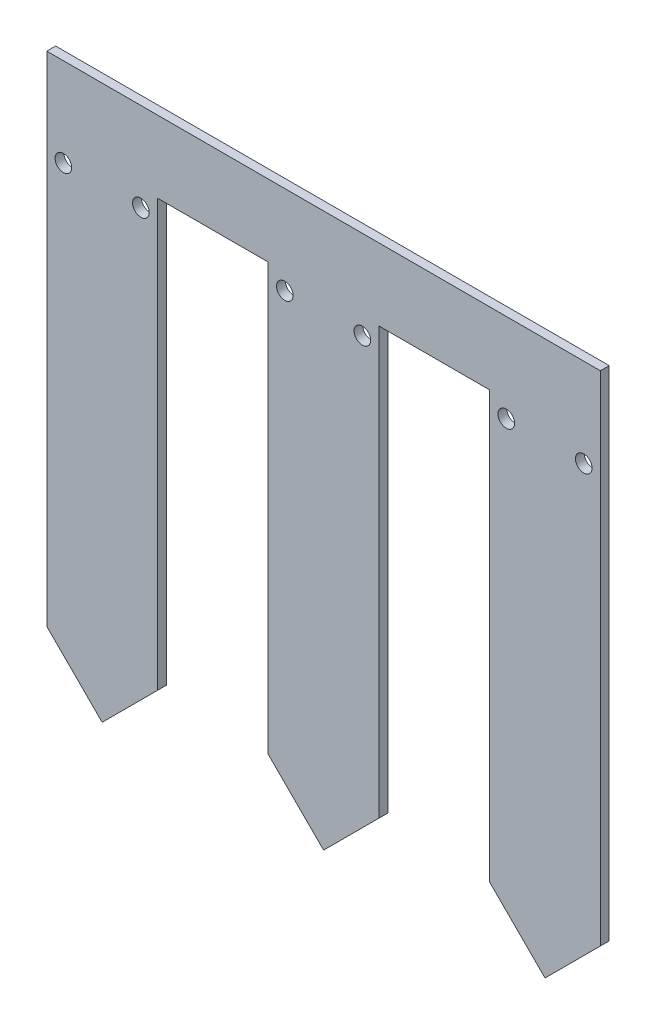
ISO-10303-21;
HEADER;
FILE_DESCRIPTION(('STEP AP214'),'2;1');
FILE_NAME('part.step','',(''),(''),'','','');
FILE_SCHEMA(('AUTOMOTIVE_DESIGN { 1 0 10303 214 1 1 1 1 }'));
ENDSEC;
DATA;
#1=APPLICATION_CONTEXT('core data for automotive mechanical design processes');
#2=APPLICATION_PROTOCOL_DEFINITION('international standard','automotive_design',2000,#1);
#3=PRODUCT_CONTEXT('',#1,'mechanical');
#4=PRODUCT('Part','Part','',(#3));
#5=PRODUCT_RELATED_PRODUCT_CATEGORY('part','',(#4));
#6=PRODUCT_DEFINITION_FORMATION('','',#4);
#7=PRODUCT_DEFINITION_CONTEXT('part definition',#1,'design');
#8=PRODUCT_DEFINITION('design','',#6,#7);
#9=PRODUCT_DEFINITION_SHAPE('','',#8);
#10=(LENGTH_UNIT() NAMED_UNIT(*) SI_UNIT(.MILLI.,.METRE.));
#11=(NAMED_UNIT(*) PLANE_ANGLE_UNIT() SI_UNIT($,.RADIAN.));
#12=(NAMED_UNIT(*) SI_UNIT($,.STERADIAN.) SOLID_ANGLE_UNIT());
#13=UNCERTAINTY_MEASURE_WITH_UNIT(LENGTH_MEASURE(1.E-05),#10,'distance_accuracy_value','');
#14=(GEOMETRIC_REPRESENTATION_CONTEXT(3) GLOBAL_UNCERTAINTY_ASSIGNED_CONTEXT((#13)) GLOBAL_UNIT_ASSIGNED_CONTEXT((#10,
#11,#12)) REPRESENTATION_CONTEXT('',''));
#15=CARTESIAN_POINT('',(0.,0.,0.));
#16=DIRECTION('',(0.,0.,1.));
#17=DIRECTION('',(1.,0.,0.));
#18=AXIS2_PLACEMENT_3D('',#15,#16,#17);
#19=CARTESIAN_POINT('',(0.,0.,1.6));
#20=DIRECTION('',(0.,0.,1.));
#21=DIRECTION('',(1.,0.,0.));
#22=AXIS2_PLACEMENT_3D('',#19,#20,#21);
#23=PLANE('',#22);
#24=CARTESIAN_POINT('',(86.9999999999998,29.0000000000001,1.6));
#25=DIRECTION('',(0.,0.,1.));
#26=DIRECTION('',(1.,0.,0.));
#27=AXIS2_PLACEMENT_3D('',#24,#25,#26);
#28=CIRCLE('',#27,1.5);
#29=CARTESIAN_POINT('',(88.4999999999998,29.0000000000001,1.6));
#30=VERTEX_POINT('',#29);
#31=EDGE_CURVE('E371',#30,#30,#28,.T.);
#32=ORIENTED_EDGE('',*,*,#31,.F.);
#33=EDGE_LOOP('',(#32));
#34=FACE_BOUND('',#33,.T.);
#35=CARTESIAN_POINT('',(32.9999999999999,29.0000000000001,1.6));
#36=DIRECTION('',(0.,0.,1.));
#37=DIRECTION('',(1.,0.,0.));
#38=AXIS2_PLACEMENT_3D('',#35,#36,#37);
#39=CIRCLE('',#38,1.5);
#40=CARTESIAN_POINT('',(34.4999999999999,29.0000000000001,1.6));
#41=VERTEX_POINT('',#40);
#42=EDGE_CURVE('E355',#41,#41,#39,.T.);
#43=ORIENTED_EDGE('',*,*,#42,.F.);
#44=EDGE_LOOP('',(#43));
#45=FACE_BOUND('',#44,.T.);
#46=CARTESIAN_POINT('',(-7.,29.0000000000001,1.6));
#47=DIRECTION('',(0.,0.,1.));
#48=DIRECTION('',(1.,0.,0.));
#49=AXIS2_PLACEMENT_3D('',#46,#47,#48);
#50=CIRCLE('',#49,1.5);
#51=CARTESIAN_POINT('',(-5.5,29.0000000000001,1.6));
#52=VERTEX_POINT('',#51);
#53=EDGE_CURVE('E193',#52,#52,#50,.T.);
#54=ORIENTED_EDGE('',*,*,#53,.F.);
#55=EDGE_LOOP('',(#54));
#56=FACE_BOUND('',#55,.T.);
#57=DIRECTION('',(0.,-1.,0.));
#58=VECTOR('',#57,1.);
#59=CARTESIAN_POINT('',(-10.,45.,1.6));
#60=LINE('',#59,#58);
#61=CARTESIAN_POINT('',(-10.,45.,1.6));
#62=VERTEX_POINT('',#61);
#63=CARTESIAN_POINT('',(-10.,-45.,1.6));
#64=VERTEX_POINT('',#63);
#65=EDGE_CURVE('E233',#62,#64,#60,.T.);
#66=ORIENTED_EDGE('',*,*,#65,.T.);
#67=DIRECTION('',(0.707106781186551,-0.707106781186545,0.));
#68=VECTOR('',#67,1.);
#69=CARTESIAN_POINT('',(0.,-54.9999999999999,1.6));
#70=LINE('',#69,#68);
#71=CARTESIAN_POINT('',(0.,-54.9999999999999,1.6));
#72=VERTEX_POINT('',#71);
#73=EDGE_CURVE('E123',#64,#72,#70,.T.);
#74=ORIENTED_EDGE('',*,*,#73,.T.);
#75=DIRECTION('',(0.707106781186547,0.707106781186548,0.));
#76=VECTOR('',#75,1.);
#77=CARTESIAN_POINT('',(0.,-54.9999999999999,1.6));
#78=LINE('',#77,#76);
#79=CARTESIAN_POINT('',(9.9999999999999,-45.,1.6));
#80=VERTEX_POINT('',#79);
#81=EDGE_CURVE('E282',#72,#80,#78,.T.);
#82=ORIENTED_EDGE('',*,*,#81,.T.);
#83=DIRECTION('',(0.,1.,0.));
#84=VECTOR('',#83,1.);
#85=CARTESIAN_POINT('',(9.9999999999999,32.0000000000001,1.6));
#86=LINE('',#85,#84);
#87=CARTESIAN_POINT('',(9.9999999999999,32.0000000000001,1.6));
#88=VERTEX_POINT('',#87);
#89=EDGE_CURVE('E300',#80,#88,#86,.T.);
#90=ORIENTED_EDGE('',*,*,#89,.T.);
#91=DIRECTION('',(1.,0.,0.));
#92=VECTOR('',#91,1.);
#93=CARTESIAN_POINT('',(9.9999999999999,32.0000000000001,1.6));
#94=LINE('',#93,#92);
#95=CARTESIAN_POINT('',(29.9999999999999,32.0000000000001,1.6));
#96=VERTEX_POINT('',#95);
#97=EDGE_CURVE('E296',#88,#96,#94,.T.);
#98=ORIENTED_EDGE('',*,*,#97,.T.);
#99=DIRECTION('',(0.,-1.,0.));
#100=VECTOR('',#99,1.);
#101=CARTESIAN_POINT('',(29.9999999999999,32.0000000000001,1.6));
#102=LINE('',#101,#100);
#103=CARTESIAN_POINT('',(30.,-44.9999999999999,1.6));
#104=VERTEX_POINT('',#103);
#105=EDGE_CURVE('E299',#96,#104,#102,.T.);
#106=ORIENTED_EDGE('',*,*,#105,.T.);
#107=DIRECTION('',(0.707106781186545,-0.70710678118655,0.));
#108=VECTOR('',#107,1.);
#109=CARTESIAN_POINT('',(30.,-44.9999999999999,1.6));
#110=LINE('',#109,#108);
#111=CARTESIAN_POINT('',(39.9999999999999,-54.9999999999999,1.6));
#112=VERTEX_POINT('',#111);
#113=EDGE_CURVE('E304',#104,#112,#110,.T.);
#114=ORIENTED_EDGE('',*,*,#113,.T.);
#115=DIRECTION('',(0.707106781186547,0.707106781186548,0.));
#116=VECTOR('',#115,1.);
#117=CARTESIAN_POINT('',(39.9999999999999,-54.9999999999999,1.6));
#118=LINE('',#117,#116);
#119=CARTESIAN_POINT('',(49.9999999999999,-44.9999999999999,1.6));
#120=VERTEX_POINT('',#119);
#121=EDGE_CURVE('E311',#112,#120,#118,.T.);
#122=ORIENTED_EDGE('',*,*,#121,.T.);
#123=DIRECTION('',(0.,1.,0.));
#124=VECTOR('',#123,1.);
#125=CARTESIAN_POINT('',(49.9999999999999,-44.9999999999999,1.6));
#126=LINE('',#125,#124);
#127=CARTESIAN_POINT('',(49.9999999999999,32.0000000000001,1.6));
#128=VERTEX_POINT('',#127);
#129=EDGE_CURVE('E314',#120,#128,#126,.T.);
#130=ORIENTED_EDGE('',*,*,#129,.T.);
#131=DIRECTION('',(1.,0.,0.));
#132=VECTOR('',#131,1.);
#133=CARTESIAN_POINT('',(49.9999999999999,32.0000000000001,1.6));
#134=LINE('',#133,#132);
#135=CARTESIAN_POINT('',(69.9999999999999,32.0000000000001,1.6));
#136=VERTEX_POINT('',#135);
#137=EDGE_CURVE('E317',#128,#136,#134,.T.);
#138=ORIENTED_EDGE('',*,*,#137,.T.);
#139=DIRECTION('',(0.,-1.,0.));
#140=VECTOR('',#139,1.);
#141=CARTESIAN_POINT('',(69.9999999999999,32.0000000000001,1.6));
#142=LINE('',#141,#140);
#143=CARTESIAN_POINT('',(69.9999999999999,-44.9999999999999,1.6));
#144=VERTEX_POINT('',#143);
#145=EDGE_CURVE('E320',#136,#144,#142,.T.);
#146=ORIENTED_EDGE('',*,*,#145,.T.);
#147=DIRECTION('',(0.707106781186548,-0.707106781186547,0.));
#148=VECTOR('',#147,1.);
#149=CARTESIAN_POINT('',(69.9999999999999,-44.9999999999999,1.6));
#150=LINE('',#149,#148);
#151=CARTESIAN_POINT('',(79.9999999999999,-54.9999999999998,1.6));
#152=VERTEX_POINT('',#151);
#153=EDGE_CURVE('E164',#144,#152,#150,.T.);
#154=ORIENTED_EDGE('',*,*,#153,.T.);
#155=DIRECTION('',(0.707106781186547,0.707106781186548,0.));
#156=VECTOR('',#155,1.);
#157=CARTESIAN_POINT('',(79.9999999999999,-54.9999999999998,1.6));
#158=LINE('',#157,#156);
#159=CARTESIAN_POINT('',(89.9999999999998,-44.9999999999998,1.6));
#160=VERTEX_POINT('',#159);
#161=EDGE_CURVE('E157',#152,#160,#158,.T.);
#162=ORIENTED_EDGE('',*,*,#161,.T.);
#163=DIRECTION('',(0.,1.,0.));
#164=VECTOR('',#163,1.);
#165=CARTESIAN_POINT('',(89.9999999999998,-44.9999999999998,1.6));
#166=LINE('',#165,#164);
#167=CARTESIAN_POINT('',(89.9999999999998,45.,1.6));
#168=VERTEX_POINT('',#167);
#169=EDGE_CURVE('E161',#160,#168,#166,.T.);
#170=ORIENTED_EDGE('',*,*,#169,.T.);
#171=DIRECTION('',(-1.,0.,0.));
#172=VECTOR('',#171,1.);
#173=CARTESIAN_POINT('',(10.,45.,1.6));
#174=LINE('',#173,#172);
#175=EDGE_CURVE('E61',#168,#62,#174,.T.);
#176=ORIENTED_EDGE('',*,*,#175,.T.);
#177=EDGE_LOOP('',(#66,#74,#82,#90,#98,#106,#114,#122,#130,#138,#146,#154,#162,#170,#176));
#178=FACE_BOUND('',#177,.T.);
#179=CARTESIAN_POINT('',(7.,29.0000000000001,1.6));
#180=DIRECTION('',(0.,0.,1.));
#181=DIRECTION('',(1.,0.,0.));
#182=AXIS2_PLACEMENT_3D('',#179,#180,#181);
#183=CIRCLE('',#182,1.5);
#184=CARTESIAN_POINT('',(8.5,29.0000000000001,1.6));
#185=VERTEX_POINT('',#184);
#186=EDGE_CURVE('E347',#185,#185,#183,.T.);
#187=ORIENTED_EDGE('',*,*,#186,.F.);
#188=EDGE_LOOP('',(#187));
#189=FACE_BOUND('',#188,.T.);
#190=CARTESIAN_POINT('',(46.9999999999999,29.0000000000001,1.6));
#191=DIRECTION('',(0.,0.,1.));
#192=DIRECTION('',(1.,0.,0.));
#193=AXIS2_PLACEMENT_3D('',#190,#191,#192);
#194=CIRCLE('',#193,1.5);
#195=CARTESIAN_POINT('',(48.4999999999999,29.0000000000001,1.6));
#196=VERTEX_POINT('',#195);
#197=EDGE_CURVE('E363',#196,#196,#194,.T.);
#198=ORIENTED_EDGE('',*,*,#197,.F.);
#199=EDGE_LOOP('',(#198));
#200=FACE_BOUND('',#199,.T.);
#201=CARTESIAN_POINT('',(72.9999999999999,29.0000000000001,1.6));
#202=DIRECTION('',(0.,0.,1.));
#203=DIRECTION('',(1.,0.,0.));
#204=AXIS2_PLACEMENT_3D('',#201,#202,#203);
#205=CIRCLE('',#204,1.5);
#206=CARTESIAN_POINT('',(74.4999999999999,29.0000000000001,1.6));
#207=VERTEX_POINT('',#206);
#208=EDGE_CURVE('E379',#207,#207,#205,.T.);
#209=ORIENTED_EDGE('',*,*,#208,.F.);
#210=EDGE_LOOP('',(#209));
#211=FACE_BOUND('',#210,.T.);
#212=ADVANCED_FACE('F43',(#34,#45,#56,#178,#189,#200,#211),#23,.T.);
#213=CARTESIAN_POINT('',(0.,0.,0.));
#214=DIRECTION('',(0.,0.,1.));
#215=DIRECTION('',(1.,0.,0.));
#216=AXIS2_PLACEMENT_3D('',#213,#214,#215);
#217=PLANE('',#216);
#218=DIRECTION('',(0.,-1.,0.));
#219=VECTOR('',#218,1.);
#220=CARTESIAN_POINT('',(-10.,45.,0.));
#221=LINE('',#220,#219);
#222=CARTESIAN_POINT('',(-10.,45.,0.));
#223=VERTEX_POINT('',#222);
#224=CARTESIAN_POINT('',(-10.,-45.,0.));
#225=VERTEX_POINT('',#224);
#226=EDGE_CURVE('E188',#223,#225,#221,.T.);
#227=ORIENTED_EDGE('',*,*,#226,.F.);
#228=DIRECTION('',(-1.,0.,0.));
#229=VECTOR('',#228,1.);
#230=CARTESIAN_POINT('',(-10.,45.,0.));
#231=LINE('',#230,#229);
#232=CARTESIAN_POINT('',(89.9999999999998,45.,0.));
#233=VERTEX_POINT('',#232);
#234=EDGE_CURVE('E111',#233,#223,#231,.T.);
#235=ORIENTED_EDGE('',*,*,#234,.F.);
#236=DIRECTION('',(0.,1.,0.));
#237=VECTOR('',#236,1.);
#238=CARTESIAN_POINT('',(89.9999999999998,-44.9999999999998,0.));
#239=LINE('',#238,#237);
#240=CARTESIAN_POINT('',(89.9999999999998,-44.9999999999998,0.));
#241=VERTEX_POINT('',#240);
#242=EDGE_CURVE('E228',#241,#233,#239,.T.);
#243=ORIENTED_EDGE('',*,*,#242,.F.);
#244=DIRECTION('',(0.707106781186547,0.707106781186548,0.));
#245=VECTOR('',#244,1.);
#246=CARTESIAN_POINT('',(79.9999999999999,-54.9999999999998,0.));
#247=LINE('',#246,#245);
#248=CARTESIAN_POINT('',(79.9999999999999,-54.9999999999998,0.));
#249=VERTEX_POINT('',#248);
#250=EDGE_CURVE('E174',#249,#241,#247,.T.);
#251=ORIENTED_EDGE('',*,*,#250,.F.);
#252=DIRECTION('',(0.707106781186548,-0.707106781186547,0.));
#253=VECTOR('',#252,1.);
#254=CARTESIAN_POINT('',(69.9999999999999,-44.9999999999999,0.));
#255=LINE('',#254,#253);
#256=CARTESIAN_POINT('',(69.9999999999999,-44.9999999999999,0.));
#257=VERTEX_POINT('',#256);
#258=EDGE_CURVE('E223',#257,#249,#255,.T.);
#259=ORIENTED_EDGE('',*,*,#258,.F.);
#260=DIRECTION('',(0.,-1.,0.));
#261=VECTOR('',#260,1.);
#262=CARTESIAN_POINT('',(69.9999999999999,32.0000000000001,0.));
#263=LINE('',#262,#261);
#264=CARTESIAN_POINT('',(69.9999999999999,32.0000000000001,0.));
#265=VERTEX_POINT('',#264);
#266=EDGE_CURVE('E220',#265,#257,#263,.T.);
#267=ORIENTED_EDGE('',*,*,#266,.F.);
#268=DIRECTION('',(1.,0.,0.));
#269=VECTOR('',#268,1.);
#270=CARTESIAN_POINT('',(49.9999999999999,32.0000000000001,0.));
#271=LINE('',#270,#269);
#272=CARTESIAN_POINT('',(49.9999999999999,32.0000000000001,0.));
#273=VERTEX_POINT('',#272);
#274=EDGE_CURVE('E217',#273,#265,#271,.T.);
#275=ORIENTED_EDGE('',*,*,#274,.F.);
#276=DIRECTION('',(0.,1.,0.));
#277=VECTOR('',#276,1.);
#278=CARTESIAN_POINT('',(49.9999999999999,-44.9999999999999,0.));
#279=LINE('',#278,#277);
#280=CARTESIAN_POINT('',(49.9999999999999,-44.9999999999999,0.));
#281=VERTEX_POINT('',#280);
#282=EDGE_CURVE('E214',#281,#273,#279,.T.);
#283=ORIENTED_EDGE('',*,*,#282,.F.);
#284=DIRECTION('',(0.707106781186547,0.707106781186548,0.));
#285=VECTOR('',#284,1.);
#286=CARTESIAN_POINT('',(39.9999999999999,-54.9999999999999,0.));
#287=LINE('',#286,#285);
#288=CARTESIAN_POINT('',(39.9999999999999,-54.9999999999999,0.));
#289=VERTEX_POINT('',#288);
#290=EDGE_CURVE('E211',#289,#281,#287,.T.);
#291=ORIENTED_EDGE('',*,*,#290,.F.);
#292=DIRECTION('',(0.707106781186545,-0.70710678118655,0.));
#293=VECTOR('',#292,1.);
#294=CARTESIAN_POINT('',(30.,-44.9999999999999,0.));
#295=LINE('',#294,#293);
#296=CARTESIAN_POINT('',(30.,-44.9999999999999,0.));
#297=VERTEX_POINT('',#296);
#298=EDGE_CURVE('E208',#297,#289,#295,.T.);
#299=ORIENTED_EDGE('',*,*,#298,.F.);
#300=DIRECTION('',(0.,-1.,0.));
#301=VECTOR('',#300,1.);
#302=CARTESIAN_POINT('',(29.9999999999999,32.0000000000001,0.));
#303=LINE('',#302,#301);
#304=CARTESIAN_POINT('',(29.9999999999999,32.0000000000001,0.));
#305=VERTEX_POINT('',#304);
#306=EDGE_CURVE('E205',#305,#297,#303,.T.);
#307=ORIENTED_EDGE('',*,*,#306,.F.);
#308=DIRECTION('',(1.,0.,0.));
#309=VECTOR('',#308,1.);
#310=CARTESIAN_POINT('',(9.9999999999999,32.0000000000001,0.));
#311=LINE('',#310,#309);
#312=CARTESIAN_POINT('',(9.9999999999999,32.0000000000001,0.));
#313=VERTEX_POINT('',#312);
#314=EDGE_CURVE('E202',#313,#305,#311,.T.);
#315=ORIENTED_EDGE('',*,*,#314,.F.);
#316=DIRECTION('',(0.,1.,0.));
#317=VECTOR('',#316,1.);
#318=CARTESIAN_POINT('',(9.9999999999999,32.0000000000001,0.));
#319=LINE('',#318,#317);
#320=CARTESIAN_POINT('',(9.9999999999999,-45.,0.));
#321=VERTEX_POINT('',#320);
#322=EDGE_CURVE('E199',#321,#313,#319,.T.);
#323=ORIENTED_EDGE('',*,*,#322,.F.);
#324=DIRECTION('',(0.707106781186547,0.707106781186548,0.));
#325=VECTOR('',#324,1.);
#326=CARTESIAN_POINT('',(0.,-54.9999999999999,0.));
#327=LINE('',#326,#325);
#328=CARTESIAN_POINT('',(0.,-54.9999999999999,0.));
#329=VERTEX_POINT('',#328);
#330=EDGE_CURVE('E196',#329,#321,#327,.T.);
#331=ORIENTED_EDGE('',*,*,#330,.F.);
#332=DIRECTION('',(0.707106781186551,-0.707106781186545,0.));
#333=VECTOR('',#332,1.);
#334=CARTESIAN_POINT('',(0.,-54.9999999999999,0.));
#335=LINE('',#334,#333);
#336=EDGE_CURVE('E192',#225,#329,#335,.T.);
#337=ORIENTED_EDGE('',*,*,#336,.F.);
#338=EDGE_LOOP('',(#227,#235,#243,#251,#259,#267,#275,#283,#291,#299,#307,#315,#323,#331,#337));
#339=FACE_BOUND('',#338,.T.);
#340=CARTESIAN_POINT('',(-7.,29.0000000000001,0.));
#341=DIRECTION('',(0.,0.,1.));
#342=DIRECTION('',(1.,0.,0.));
#343=AXIS2_PLACEMENT_3D('',#340,#341,#342);
#344=CIRCLE('',#343,1.5);
#345=CARTESIAN_POINT('',(-5.5,29.0000000000001,0.));
#346=VERTEX_POINT('',#345);
#347=EDGE_CURVE('E342',#346,#346,#344,.T.);
#348=ORIENTED_EDGE('',*,*,#347,.T.);
#349=EDGE_LOOP('',(#348));
#350=FACE_BOUND('',#349,.T.);
#351=CARTESIAN_POINT('',(7.,29.0000000000001,0.));
#352=DIRECTION('',(0.,0.,1.));
#353=DIRECTION('',(1.,0.,0.));
#354=AXIS2_PLACEMENT_3D('',#351,#352,#353);
#355=CIRCLE('',#354,1.5);
#356=CARTESIAN_POINT('',(8.5,29.0000000000001,0.));
#357=VERTEX_POINT('',#356);
#358=EDGE_CURVE('E351',#357,#357,#355,.T.);
#359=ORIENTED_EDGE('',*,*,#358,.T.);
#360=EDGE_LOOP('',(#359));
#361=FACE_BOUND('',#360,.T.);
#362=CARTESIAN_POINT('',(32.9999999999999,29.0000000000001,0.));
#363=DIRECTION('',(0.,0.,1.));
#364=DIRECTION('',(1.,0.,0.));
#365=AXIS2_PLACEMENT_3D('',#362,#363,#364);
#366=CIRCLE('',#365,1.5);
#367=CARTESIAN_POINT('',(34.4999999999999,29.0000000000001,0.));
#368=VERTEX_POINT('',#367);
#369=EDGE_CURVE('E359',#368,#368,#366,.T.);
#370=ORIENTED_EDGE('',*,*,#369,.T.);
#371=EDGE_LOOP('',(#370));
#372=FACE_BOUND('',#371,.T.);
#373=CARTESIAN_POINT('',(46.9999999999999,29.0000000000001,0.));
#374=DIRECTION('',(0.,0.,1.));
#375=DIRECTION('',(1.,0.,0.));
#376=AXIS2_PLACEMENT_3D('',#373,#374,#375);
#377=CIRCLE('',#376,1.5);
#378=CARTESIAN_POINT('',(48.4999999999999,29.0000000000001,0.));
#379=VERTEX_POINT('',#378);
#380=EDGE_CURVE('E367',#379,#379,#377,.T.);
#381=ORIENTED_EDGE('',*,*,#380,.T.);
#382=EDGE_LOOP('',(#381));
#383=FACE_BOUND('',#382,.T.);
#384=CARTESIAN_POINT('',(86.9999999999998,29.0000000000001,0.));
#385=DIRECTION('',(0.,0.,1.));
#386=DIRECTION('',(1.,0.,0.));
#387=AXIS2_PLACEMENT_3D('',#384,#385,#386);
#388=CIRCLE('',#387,1.5);
#389=CARTESIAN_POINT('',(88.4999999999998,29.0000000000001,0.));
#390=VERTEX_POINT('',#389);
#391=EDGE_CURVE('E375',#390,#390,#388,.T.);
#392=ORIENTED_EDGE('',*,*,#391,.T.);
#393=EDGE_LOOP('',(#392));
#394=FACE_BOUND('',#393,.T.);
#395=CARTESIAN_POINT('',(72.9999999999999,29.0000000000001,0.));
#396=DIRECTION('',(0.,0.,1.));
#397=DIRECTION('',(1.,0.,0.));
#398=AXIS2_PLACEMENT_3D('',#395,#396,#397);
#399=CIRCLE('',#398,1.5);
#400=CARTESIAN_POINT('',(74.4999999999999,29.0000000000001,0.));
#401=VERTEX_POINT('',#400);
#402=EDGE_CURVE('E383',#401,#401,#399,.T.);
#403=ORIENTED_EDGE('',*,*,#402,.T.);
#404=EDGE_LOOP('',(#403));
#405=FACE_BOUND('',#404,.T.);
#406=ADVANCED_FACE('F284',(#339,#350,#361,#372,#383,#394,#405),#217,.F.);
#407=CARTESIAN_POINT('',(-10.,45.,1.6));
#408=DIRECTION('',(1.,0.,0.));
#409=DIRECTION('',(0.,0.,-1.));
#410=AXIS2_PLACEMENT_3D('',#407,#408,#409);
#411=PLANE('',#410);
#412=ORIENTED_EDGE('',*,*,#226,.T.);
#413=DIRECTION('',(0.,0.,-1.));
#414=VECTOR('',#413,1.);
#415=CARTESIAN_POINT('',(-10.,-45.,1.6));
#416=LINE('',#415,#414);
#417=EDGE_CURVE('E11',#64,#225,#416,.T.);
#418=ORIENTED_EDGE('',*,*,#417,.F.);
#419=ORIENTED_EDGE('',*,*,#65,.F.);
#420=DIRECTION('',(0.,0.,-1.));
#421=VECTOR('',#420,1.);
#422=CARTESIAN_POINT('',(-10.,45.,1.6));
#423=LINE('',#422,#421);
#424=EDGE_CURVE('E184',#62,#223,#423,.T.);
#425=ORIENTED_EDGE('',*,*,#424,.T.);
#426=EDGE_LOOP('',(#412,#418,#419,#425));
#427=FACE_BOUND('',#426,.T.);
#428=ADVANCED_FACE('F45',(#427),#411,.F.);
#429=CARTESIAN_POINT('',(0.,-54.9999999999999,1.6));
#430=DIRECTION('',(0.707106781186545,0.707106781186551,0.));
#431=DIRECTION('',(-0.707106781186551,0.707106781186545,0.));
#432=AXIS2_PLACEMENT_3D('',#429,#430,#431);
#433=PLANE('',#432);
#434=ORIENTED_EDGE('',*,*,#336,.T.);
#435=DIRECTION('',(0.,0.,-1.));
#436=VECTOR('',#435,1.);
#437=CARTESIAN_POINT('',(0.,-54.9999999999999,1.6));
#438=LINE('',#437,#436);
#439=EDGE_CURVE('E53',#72,#329,#438,.T.);
#440=ORIENTED_EDGE('',*,*,#439,.F.);
#441=ORIENTED_EDGE('',*,*,#73,.F.);
#442=ORIENTED_EDGE('',*,*,#417,.T.);
#443=EDGE_LOOP('',(#434,#440,#441,#442));
#444=FACE_BOUND('',#443,.T.);
#445=ADVANCED_FACE('F442',(#444),#433,.F.);
#446=CARTESIAN_POINT('',(0.,-54.9999999999999,1.6));
#447=DIRECTION('',(-0.707106781186548,0.707106781186547,0.));
#448=DIRECTION('',(-0.707106781186547,-0.707106781186548,0.));
#449=AXIS2_PLACEMENT_3D('',#446,#447,#448);
#450=PLANE('',#449);
#451=ORIENTED_EDGE('',*,*,#330,.T.);
#452=DIRECTION('',(0.,0.,-1.));
#453=VECTOR('',#452,1.);
#454=CARTESIAN_POINT('',(9.9999999999999,-45.,1.6));
#455=LINE('',#454,#453);
#456=EDGE_CURVE('E272',#80,#321,#455,.T.);
#457=ORIENTED_EDGE('',*,*,#456,.F.);
#458=ORIENTED_EDGE('',*,*,#81,.F.);
#459=ORIENTED_EDGE('',*,*,#439,.T.);
#460=EDGE_LOOP('',(#451,#457,#458,#459));
#461=FACE_BOUND('',#460,.T.);
#462=ADVANCED_FACE('F280',(#461),#450,.F.);
#463=CARTESIAN_POINT('',(9.9999999999999,32.0000000000001,1.6));
#464=DIRECTION('',(-1.,0.,0.));
#465=DIRECTION('',(0.,-1.,0.));
#466=AXIS2_PLACEMENT_3D('',#463,#464,#465);
#467=PLANE('',#466);
#468=ORIENTED_EDGE('',*,*,#322,.T.);
#469=DIRECTION('',(0.,0.,-1.));
#470=VECTOR('',#469,1.);
#471=CARTESIAN_POINT('',(9.9999999999999,32.0000000000001,1.6));
#472=LINE('',#471,#470);
#473=EDGE_CURVE('E268',#88,#313,#472,.T.);
#474=ORIENTED_EDGE('',*,*,#473,.F.);
#475=ORIENTED_EDGE('',*,*,#89,.F.);
#476=ORIENTED_EDGE('',*,*,#456,.T.);
#477=EDGE_LOOP('',(#468,#474,#475,#476));
#478=FACE_BOUND('',#477,.T.);
#479=ADVANCED_FACE('F290',(#478),#467,.F.);
#480=CARTESIAN_POINT('',(9.9999999999999,32.0000000000001,1.6));
#481=DIRECTION('',(0.,1.,0.));
#482=DIRECTION('',(0.,0.,1.));
#483=AXIS2_PLACEMENT_3D('',#480,#481,#482);
#484=PLANE('',#483);
#485=ORIENTED_EDGE('',*,*,#314,.T.);
#486=DIRECTION('',(0.,0.,-1.));
#487=VECTOR('',#486,1.);
#488=CARTESIAN_POINT('',(29.9999999999999,32.0000000000001,1.6));
#489=LINE('',#488,#487);
#490=EDGE_CURVE('E264',#96,#305,#489,.T.);
#491=ORIENTED_EDGE('',*,*,#490,.F.);
#492=ORIENTED_EDGE('',*,*,#97,.F.);
#493=ORIENTED_EDGE('',*,*,#473,.T.);
#494=EDGE_LOOP('',(#485,#491,#492,#493));
#495=FACE_BOUND('',#494,.T.);
#496=ADVANCED_FACE('F294',(#495),#484,.F.);
#497=CARTESIAN_POINT('',(29.9999999999999,32.0000000000001,1.6));
#498=DIRECTION('',(1.,0.,0.));
#499=DIRECTION('',(0.,1.,0.));
#500=AXIS2_PLACEMENT_3D('',#497,#498,#499);
#501=PLANE('',#500);
#502=ORIENTED_EDGE('',*,*,#306,.T.);
#503=DIRECTION('',(0.,0.,-1.));
#504=VECTOR('',#503,1.);
#505=CARTESIAN_POINT('',(30.,-44.9999999999999,1.6));
#506=LINE('',#505,#504);
#507=EDGE_CURVE('E260',#104,#297,#506,.T.);
#508=ORIENTED_EDGE('',*,*,#507,.F.);
#509=ORIENTED_EDGE('',*,*,#105,.F.);
#510=ORIENTED_EDGE('',*,*,#490,.T.);
#511=EDGE_LOOP('',(#502,#508,#509,#510));
#512=FACE_BOUND('',#511,.T.);
#513=ADVANCED_FACE('F432',(#512),#501,.F.);
#514=CARTESIAN_POINT('',(30.,-44.9999999999999,1.6));
#515=DIRECTION('',(0.70710678118655,0.707106781186545,0.));
#516=DIRECTION('',(-0.707106781186545,0.70710678118655,0.));
#517=AXIS2_PLACEMENT_3D('',#514,#515,#516);
#518=PLANE('',#517);
#519=ORIENTED_EDGE('',*,*,#298,.T.);
#520=DIRECTION('',(0.,0.,-1.));
#521=VECTOR('',#520,1.);
#522=CARTESIAN_POINT('',(39.9999999999999,-54.9999999999999,1.6));
#523=LINE('',#522,#521);
#524=EDGE_CURVE('E256',#112,#289,#523,.T.);
#525=ORIENTED_EDGE('',*,*,#524,.F.);
#526=ORIENTED_EDGE('',*,*,#113,.F.);
#527=ORIENTED_EDGE('',*,*,#507,.T.);
#528=EDGE_LOOP('',(#519,#525,#526,#527));
#529=FACE_BOUND('',#528,.T.);
#530=ADVANCED_FACE('F428',(#529),#518,.F.);
#531=CARTESIAN_POINT('',(39.9999999999999,-54.9999999999999,1.6));
#532=DIRECTION('',(-0.707106781186548,0.707106781186547,0.));
#533=DIRECTION('',(-0.707106781186547,-0.707106781186548,0.));
#534=AXIS2_PLACEMENT_3D('',#531,#532,#533);
#535=PLANE('',#534);
#536=ORIENTED_EDGE('',*,*,#290,.T.);
#537=DIRECTION('',(0.,0.,-1.));
#538=VECTOR('',#537,1.);
#539=CARTESIAN_POINT('',(49.9999999999999,-44.9999999999999,1.6));
#540=LINE('',#539,#538);
#541=EDGE_CURVE('E252',#120,#281,#540,.T.);
#542=ORIENTED_EDGE('',*,*,#541,.F.);
#543=ORIENTED_EDGE('',*,*,#121,.F.);
#544=ORIENTED_EDGE('',*,*,#524,.T.);
#545=EDGE_LOOP('',(#536,#542,#543,#544));
#546=FACE_BOUND('',#545,.T.);
#547=ADVANCED_FACE('F424',(#546),#535,.F.);
#548=CARTESIAN_POINT('',(49.9999999999999,-44.9999999999999,1.6));
#549=DIRECTION('',(-1.,0.,0.));
#550=DIRECTION('',(0.,0.,1.));
#551=AXIS2_PLACEMENT_3D('',#548,#549,#550);
#552=PLANE('',#551);
#553=ORIENTED_EDGE('',*,*,#282,.T.);
#554=DIRECTION('',(0.,0.,-1.));
#555=VECTOR('',#554,1.);
#556=CARTESIAN_POINT('',(49.9999999999999,32.0000000000001,1.6));
#557=LINE('',#556,#555);
#558=EDGE_CURVE('E248',#128,#273,#557,.T.);
#559=ORIENTED_EDGE('',*,*,#558,.F.);
#560=ORIENTED_EDGE('',*,*,#129,.F.);
#561=ORIENTED_EDGE('',*,*,#541,.T.);
#562=EDGE_LOOP('',(#553,#559,#560,#561));
#563=FACE_BOUND('',#562,.T.);
#564=ADVANCED_FACE('F420',(#563),#552,.F.);
#565=CARTESIAN_POINT('',(49.9999999999999,32.0000000000001,1.6));
#566=DIRECTION('',(0.,1.,0.));
#567=DIRECTION('',(0.,0.,1.));
#568=AXIS2_PLACEMENT_3D('',#565,#566,#567);
#569=PLANE('',#568);
#570=ORIENTED_EDGE('',*,*,#274,.T.);
#571=DIRECTION('',(0.,0.,-1.));
#572=VECTOR('',#571,1.);
#573=CARTESIAN_POINT('',(69.9999999999999,32.0000000000001,1.6));
#574=LINE('',#573,#572);
#575=EDGE_CURVE('E244',#136,#265,#574,.T.);
#576=ORIENTED_EDGE('',*,*,#575,.F.);
#577=ORIENTED_EDGE('',*,*,#137,.F.);
#578=ORIENTED_EDGE('',*,*,#558,.T.);
#579=EDGE_LOOP('',(#570,#576,#577,#578));
#580=FACE_BOUND('',#579,.T.);
#581=ADVANCED_FACE('F417',(#580),#569,.F.);
#582=CARTESIAN_POINT('',(69.9999999999999,32.0000000000001,1.6));
#583=DIRECTION('',(1.,0.,0.));
#584=DIRECTION('',(0.,0.,-1.));
#585=AXIS2_PLACEMENT_3D('',#582,#583,#584);
#586=PLANE('',#585);
#587=ORIENTED_EDGE('',*,*,#266,.T.);
#588=DIRECTION('',(0.,0.,-1.));
#589=VECTOR('',#588,1.);
#590=CARTESIAN_POINT('',(69.9999999999999,-44.9999999999999,1.6));
#591=LINE('',#590,#589);
#592=EDGE_CURVE('E240',#144,#257,#591,.T.);
#593=ORIENTED_EDGE('',*,*,#592,.F.);
#594=ORIENTED_EDGE('',*,*,#145,.F.);
#595=ORIENTED_EDGE('',*,*,#575,.T.);
#596=EDGE_LOOP('',(#587,#593,#594,#595));
#597=FACE_BOUND('',#596,.T.);
#598=ADVANCED_FACE('F328',(#597),#586,.F.);
#599=CARTESIAN_POINT('',(69.9999999999999,-44.9999999999999,1.6));
#600=DIRECTION('',(0.707106781186547,0.707106781186548,0.));
#601=DIRECTION('',(-0.707106781186548,0.707106781186547,0.));
#602=AXIS2_PLACEMENT_3D('',#599,#600,#601);
#603=PLANE('',#602);
#604=ORIENTED_EDGE('',*,*,#258,.T.);
#605=DIRECTION('',(0.,0.,-1.));
#606=VECTOR('',#605,1.);
#607=CARTESIAN_POINT('',(79.9999999999999,-54.9999999999998,1.6));
#608=LINE('',#607,#606);
#609=EDGE_CURVE('E177',#152,#249,#608,.T.);
#610=ORIENTED_EDGE('',*,*,#609,.F.);
#611=ORIENTED_EDGE('',*,*,#153,.F.);
#612=ORIENTED_EDGE('',*,*,#592,.T.);
#613=EDGE_LOOP('',(#604,#610,#611,#612));
#614=FACE_BOUND('',#613,.T.);
#615=ADVANCED_FACE('F332',(#614),#603,.F.);
#616=CARTESIAN_POINT('',(79.9999999999999,-54.9999999999998,1.6));
#617=DIRECTION('',(-0.707106781186548,0.707106781186547,0.));
#618=DIRECTION('',(-0.707106781186547,-0.707106781186548,0.));
#619=AXIS2_PLACEMENT_3D('',#616,#617,#618);
#620=PLANE('',#619);
#621=ORIENTED_EDGE('',*,*,#250,.T.);
#622=DIRECTION('',(0.,0.,-1.));
#623=VECTOR('',#622,1.);
#624=CARTESIAN_POINT('',(89.9999999999998,-44.9999999999998,1.6));
#625=LINE('',#624,#623);
#626=EDGE_CURVE('E171',#160,#241,#625,.T.);
#627=ORIENTED_EDGE('',*,*,#626,.F.);
#628=ORIENTED_EDGE('',*,*,#161,.F.);
#629=ORIENTED_EDGE('',*,*,#609,.T.);
#630=EDGE_LOOP('',(#621,#627,#628,#629));
#631=FACE_BOUND('',#630,.T.);
#632=ADVANCED_FACE('F172',(#631),#620,.F.);
#633=CARTESIAN_POINT('',(89.9999999999998,-44.9999999999998,1.6));
#634=DIRECTION('',(-1.,0.,0.));
#635=DIRECTION('',(0.,-1.,0.));
#636=AXIS2_PLACEMENT_3D('',#633,#634,#635);
#637=PLANE('',#636);
#638=ORIENTED_EDGE('',*,*,#242,.T.);
#639=DIRECTION('',(0.,0.,-1.));
#640=VECTOR('',#639,1.);
#641=CARTESIAN_POINT('',(89.9999999999998,45.,1.6));
#642=LINE('',#641,#640);
#643=EDGE_CURVE('E178',#168,#233,#642,.T.);
#644=ORIENTED_EDGE('',*,*,#643,.F.);
#645=ORIENTED_EDGE('',*,*,#169,.F.);
#646=ORIENTED_EDGE('',*,*,#626,.T.);
#647=EDGE_LOOP('',(#638,#644,#645,#646));
#648=FACE_BOUND('',#647,.T.);
#649=ADVANCED_FACE('F180',(#648),#637,.F.);
#650=CARTESIAN_POINT('',(-10.,45.,1.6));
#651=DIRECTION('',(0.,-1.,0.));
#652=DIRECTION('',(0.,0.,-1.));
#653=AXIS2_PLACEMENT_3D('',#650,#651,#652);
#654=PLANE('',#653);
#655=ORIENTED_EDGE('',*,*,#234,.T.);
#656=ORIENTED_EDGE('',*,*,#424,.F.);
#657=ORIENTED_EDGE('',*,*,#175,.F.);
#658=ORIENTED_EDGE('',*,*,#643,.T.);
#659=EDGE_LOOP('',(#655,#656,#657,#658));
#660=FACE_BOUND('',#659,.T.);
#661=ADVANCED_FACE('F333',(#660),#654,.F.);
#662=CARTESIAN_POINT('',(-7.,29.0000000000001,1.6));
#663=DIRECTION('',(0.,0.,-1.));
#664=DIRECTION('',(-1.,0.,0.));
#665=AXIS2_PLACEMENT_3D('',#662,#663,#664);
#666=CYLINDRICAL_SURFACE('',#665,1.5);
#667=ORIENTED_EDGE('',*,*,#53,.T.);
#668=EDGE_LOOP('',(#667));
#669=FACE_BOUND('',#668,.T.);
#670=ORIENTED_EDGE('',*,*,#347,.F.);
#671=EDGE_LOOP('',(#670));
#672=FACE_BOUND('',#671,.T.);
#673=ADVANCED_FACE('F404',(#669,#672),#666,.F.);
#674=CARTESIAN_POINT('',(7.,29.0000000000001,1.6));
#675=DIRECTION('',(0.,0.,-1.));
#676=DIRECTION('',(-1.,0.,0.));
#677=AXIS2_PLACEMENT_3D('',#674,#675,#676);
#678=CYLINDRICAL_SURFACE('',#677,1.5);
#679=ORIENTED_EDGE('',*,*,#186,.T.);
#680=EDGE_LOOP('',(#679));
#681=FACE_BOUND('',#680,.T.);
#682=ORIENTED_EDGE('',*,*,#358,.F.);
#683=EDGE_LOOP('',(#682));
#684=FACE_BOUND('',#683,.T.);
#685=ADVANCED_FACE('F557',(#681,#684),#678,.F.);
#686=CARTESIAN_POINT('',(32.9999999999999,29.0000000000001,1.6));
#687=DIRECTION('',(0.,0.,-1.));
#688=DIRECTION('',(-1.,0.,0.));
#689=AXIS2_PLACEMENT_3D('',#686,#687,#688);
#690=CYLINDRICAL_SURFACE('',#689,1.5);
#691=ORIENTED_EDGE('',*,*,#42,.T.);
#692=EDGE_LOOP('',(#691));
#693=FACE_BOUND('',#692,.T.);
#694=ORIENTED_EDGE('',*,*,#369,.F.);
#695=EDGE_LOOP('',(#694));
#696=FACE_BOUND('',#695,.T.);
#697=ADVANCED_FACE('F566',(#693,#696),#690,.F.);
#698=CARTESIAN_POINT('',(46.9999999999999,29.0000000000001,1.6));
#699=DIRECTION('',(0.,0.,-1.));
#700=DIRECTION('',(-1.,0.,0.));
#701=AXIS2_PLACEMENT_3D('',#698,#699,#700);
#702=CYLINDRICAL_SURFACE('',#701,1.5);
#703=ORIENTED_EDGE('',*,*,#197,.T.);
#704=EDGE_LOOP('',(#703));
#705=FACE_BOUND('',#704,.T.);
#706=ORIENTED_EDGE('',*,*,#380,.F.);
#707=EDGE_LOOP('',(#706));
#708=FACE_BOUND('',#707,.T.);
#709=ADVANCED_FACE('F575',(#705,#708),#702,.F.);
#710=CARTESIAN_POINT('',(86.9999999999998,29.0000000000001,1.6));
#711=DIRECTION('',(0.,0.,-1.));
#712=DIRECTION('',(-1.,0.,0.));
#713=AXIS2_PLACEMENT_3D('',#710,#711,#712);
#714=CYLINDRICAL_SURFACE('',#713,1.5);
#715=ORIENTED_EDGE('',*,*,#31,.T.);
#716=EDGE_LOOP('',(#715));
#717=FACE_BOUND('',#716,.T.);
#718=ORIENTED_EDGE('',*,*,#391,.F.);
#719=EDGE_LOOP('',(#718));
#720=FACE_BOUND('',#719,.T.);
#721=ADVANCED_FACE('F585',(#717,#720),#714,.F.);
#722=CARTESIAN_POINT('',(72.9999999999999,29.0000000000001,1.6));
#723=DIRECTION('',(0.,0.,-1.));
#724=DIRECTION('',(-1.,0.,0.));
#725=AXIS2_PLACEMENT_3D('',#722,#723,#724);
#726=CYLINDRICAL_SURFACE('',#725,1.5);
#727=ORIENTED_EDGE('',*,*,#208,.T.);
#728=EDGE_LOOP('',(#727));
#729=FACE_BOUND('',#728,.T.);
#730=ORIENTED_EDGE('',*,*,#402,.F.);
#731=EDGE_LOOP('',(#730));
#732=FACE_BOUND('',#731,.T.);
#733=ADVANCED_FACE('F391',(#729,#732),#726,.F.);
#734=CLOSED_SHELL('',(#212,#406,#428,#445,#462,#479,#496,#513,#530,#547,#564,#581,#598,#615,
#632,#649,#661,#673,#685,#697,#709,#721,#733));
#735=MANIFOLD_SOLID_BREP('B2',#734);
#736=ADVANCED_BREP_SHAPE_REPRESENTATION('',(#18,#735),#14);
#737=SHAPE_DEFINITION_REPRESENTATION(#9,#736);
ENDSEC;
END-ISO-10303-21;
